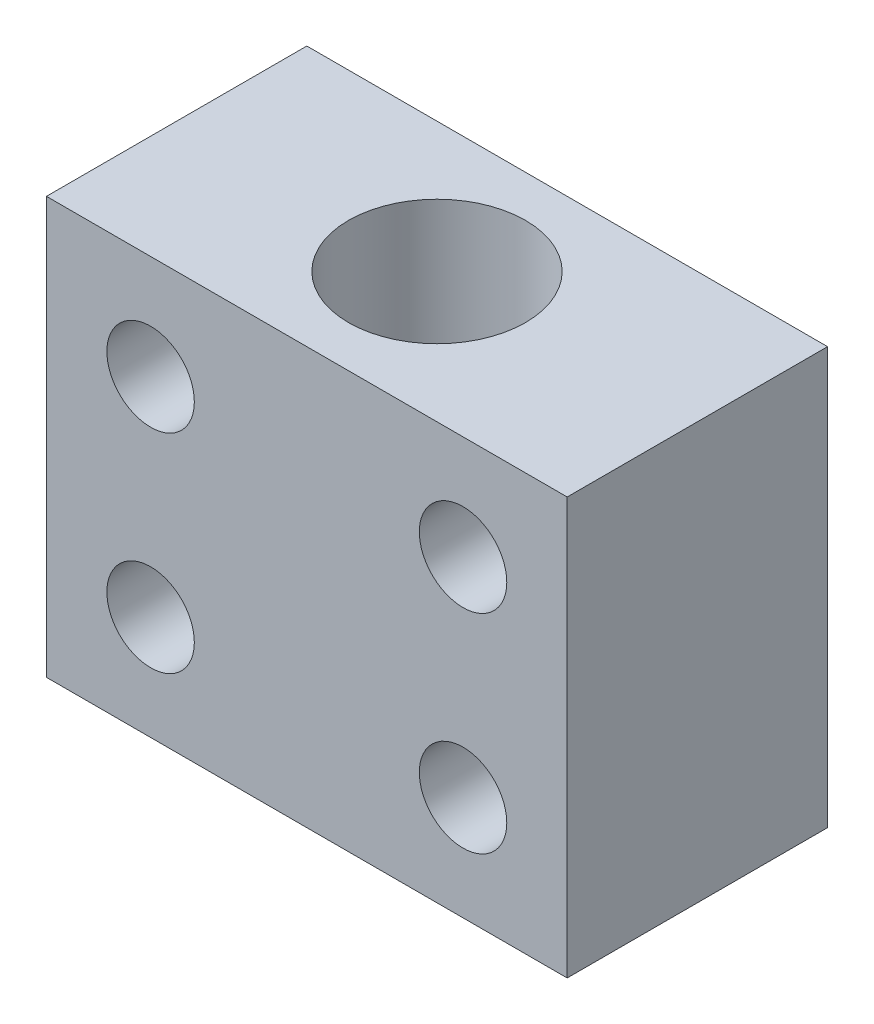
ISO-10303-21;
HEADER;
FILE_DESCRIPTION(('STEP AP214'),'2;1');
FILE_NAME('part.step','',(''),(''),'','','');
FILE_SCHEMA(('AUTOMOTIVE_DESIGN { 1 0 10303 214 1 1 1 1 }'));
ENDSEC;
DATA;
#1=APPLICATION_CONTEXT('core data for automotive mechanical design processes');
#2=APPLICATION_PROTOCOL_DEFINITION('international standard','automotive_design',2000,#1);
#3=PRODUCT_CONTEXT('',#1,'mechanical');
#4=PRODUCT('Part','Part','',(#3));
#5=PRODUCT_RELATED_PRODUCT_CATEGORY('part','',(#4));
#6=PRODUCT_DEFINITION_FORMATION('','',#4);
#7=PRODUCT_DEFINITION_CONTEXT('part definition',#1,'design');
#8=PRODUCT_DEFINITION('design','',#6,#7);
#9=PRODUCT_DEFINITION_SHAPE('','',#8);
#10=(LENGTH_UNIT() NAMED_UNIT(*) SI_UNIT(.MILLI.,.METRE.));
#11=(NAMED_UNIT(*) PLANE_ANGLE_UNIT() SI_UNIT($,.RADIAN.));
#12=(NAMED_UNIT(*) SI_UNIT($,.STERADIAN.) SOLID_ANGLE_UNIT());
#13=UNCERTAINTY_MEASURE_WITH_UNIT(LENGTH_MEASURE(1.E-05),#10,'distance_accuracy_value','');
#14=(GEOMETRIC_REPRESENTATION_CONTEXT(3) GLOBAL_UNCERTAINTY_ASSIGNED_CONTEXT((#13)) GLOBAL_UNIT_ASSIGNED_CONTEXT((#10,
#11,#12)) REPRESENTATION_CONTEXT('',''));
#15=CARTESIAN_POINT('',(0.,0.,0.));
#16=DIRECTION('',(0.,0.,1.));
#17=DIRECTION('',(1.,0.,0.));
#18=AXIS2_PLACEMENT_3D('',#15,#16,#17);
#19=CARTESIAN_POINT('',(0.,0.,-12.5));
#20=DIRECTION('',(0.,0.,-1.));
#21=DIRECTION('',(-1.,0.,0.));
#22=AXIS2_PLACEMENT_3D('',#19,#20,#21);
#23=PLANE('',#22);
#24=CARTESIAN_POINT('',(-15.,10.,-12.5));
#25=DIRECTION('',(0.,0.,1.));
#26=DIRECTION('',(1.,0.,0.));
#27=AXIS2_PLACEMENT_3D('',#24,#25,#26);
#28=CIRCLE('',#27,4.19999999999999);
#29=CARTESIAN_POINT('',(-10.8,10.,-12.5));
#30=VERTEX_POINT('',#29);
#31=EDGE_CURVE('E128',#30,#30,#28,.T.);
#32=ORIENTED_EDGE('',*,*,#31,.T.);
#33=EDGE_LOOP('',(#32));
#34=FACE_BOUND('',#33,.T.);
#35=DIRECTION('',(0.,1.,0.));
#36=VECTOR('',#35,1.);
#37=CARTESIAN_POINT('',(25.,-20.,-12.5));
#38=LINE('',#37,#36);
#39=CARTESIAN_POINT('',(25.,-20.,-12.5));
#40=VERTEX_POINT('',#39);
#41=CARTESIAN_POINT('',(25.,20.,-12.5));
#42=VERTEX_POINT('',#41);
#43=EDGE_CURVE('E97',#40,#42,#38,.T.);
#44=ORIENTED_EDGE('',*,*,#43,.F.);
#45=DIRECTION('',(1.,0.,0.));
#46=VECTOR('',#45,1.);
#47=CARTESIAN_POINT('',(-25.,-20.,-12.5));
#48=LINE('',#47,#46);
#49=CARTESIAN_POINT('',(-25.,-20.,-12.5));
#50=VERTEX_POINT('',#49);
#51=EDGE_CURVE('E73',#50,#40,#48,.T.);
#52=ORIENTED_EDGE('',*,*,#51,.F.);
#53=DIRECTION('',(0.,-1.,0.));
#54=VECTOR('',#53,1.);
#55=CARTESIAN_POINT('',(-25.,-20.,-12.5));
#56=LINE('',#55,#54);
#57=CARTESIAN_POINT('',(-25.,20.,-12.5));
#58=VERTEX_POINT('',#57);
#59=EDGE_CURVE('E67',#58,#50,#56,.T.);
#60=ORIENTED_EDGE('',*,*,#59,.F.);
#61=DIRECTION('',(-1.,0.,0.));
#62=VECTOR('',#61,1.);
#63=CARTESIAN_POINT('',(-25.,20.,-12.5));
#64=LINE('',#63,#62);
#65=EDGE_CURVE('E89',#42,#58,#64,.T.);
#66=ORIENTED_EDGE('',*,*,#65,.F.);
#67=EDGE_LOOP('',(#44,#52,#60,#66));
#68=FACE_BOUND('',#67,.T.);
#69=CARTESIAN_POINT('',(15.,10.,-12.5));
#70=DIRECTION('',(0.,0.,1.));
#71=DIRECTION('',(1.,0.,0.));
#72=AXIS2_PLACEMENT_3D('',#69,#70,#71);
#73=CIRCLE('',#72,4.19999999999999);
#74=CARTESIAN_POINT('',(19.2,10.,-12.5));
#75=VERTEX_POINT('',#74);
#76=EDGE_CURVE('E100',#75,#75,#73,.T.);
#77=ORIENTED_EDGE('',*,*,#76,.T.);
#78=EDGE_LOOP('',(#77));
#79=FACE_BOUND('',#78,.T.);
#80=CARTESIAN_POINT('',(15.,-10.,-12.5));
#81=DIRECTION('',(0.,0.,1.));
#82=DIRECTION('',(1.,0.,0.));
#83=AXIS2_PLACEMENT_3D('',#80,#81,#82);
#84=CIRCLE('',#83,4.19999999999999);
#85=CARTESIAN_POINT('',(19.2,-10.,-12.5));
#86=VERTEX_POINT('',#85);
#87=EDGE_CURVE('E116',#86,#86,#84,.T.);
#88=ORIENTED_EDGE('',*,*,#87,.T.);
#89=EDGE_LOOP('',(#88));
#90=FACE_BOUND('',#89,.T.);
#91=CARTESIAN_POINT('',(-15.,-10.,-12.5));
#92=DIRECTION('',(0.,0.,1.));
#93=DIRECTION('',(1.,0.,0.));
#94=AXIS2_PLACEMENT_3D('',#91,#92,#93);
#95=CIRCLE('',#94,4.19999999999999);
#96=CARTESIAN_POINT('',(-10.8,-10.,-12.5));
#97=VERTEX_POINT('',#96);
#98=EDGE_CURVE('E122',#97,#97,#95,.T.);
#99=ORIENTED_EDGE('',*,*,#98,.T.);
#100=EDGE_LOOP('',(#99));
#101=FACE_BOUND('',#100,.T.);
#102=ADVANCED_FACE('F33',(#34,#68,#79,#90,#101),#23,.T.);
#103=CARTESIAN_POINT('',(25.,-20.,12.5));
#104=DIRECTION('',(-1.,0.,0.));
#105=DIRECTION('',(0.,0.,1.));
#106=AXIS2_PLACEMENT_3D('',#103,#104,#105);
#107=PLANE('',#106);
#108=ORIENTED_EDGE('',*,*,#43,.T.);
#109=DIRECTION('',(0.,0.,-1.));
#110=VECTOR('',#109,1.);
#111=CARTESIAN_POINT('',(25.,20.,12.5));
#112=LINE('',#111,#110);
#113=CARTESIAN_POINT('',(25.,20.,12.5));
#114=VERTEX_POINT('',#113);
#115=EDGE_CURVE('E11',#114,#42,#112,.T.);
#116=ORIENTED_EDGE('',*,*,#115,.F.);
#117=DIRECTION('',(0.,1.,0.));
#118=VECTOR('',#117,1.);
#119=CARTESIAN_POINT('',(25.,-20.,12.5));
#120=LINE('',#119,#118);
#121=CARTESIAN_POINT('',(25.,-20.,12.5));
#122=VERTEX_POINT('',#121);
#123=EDGE_CURVE('E85',#122,#114,#120,.T.);
#124=ORIENTED_EDGE('',*,*,#123,.F.);
#125=DIRECTION('',(0.,0.,-1.));
#126=VECTOR('',#125,1.);
#127=CARTESIAN_POINT('',(25.,-20.,12.5));
#128=LINE('',#127,#126);
#129=EDGE_CURVE('E93',#122,#40,#128,.T.);
#130=ORIENTED_EDGE('',*,*,#129,.T.);
#131=EDGE_LOOP('',(#108,#116,#124,#130));
#132=FACE_BOUND('',#131,.T.);
#133=ADVANCED_FACE('F35',(#132),#107,.F.);
#134=CARTESIAN_POINT('',(-25.,20.,12.5));
#135=DIRECTION('',(0.,-1.,0.));
#136=DIRECTION('',(0.,0.,-1.));
#137=AXIS2_PLACEMENT_3D('',#134,#135,#136);
#138=PLANE('',#137);
#139=CARTESIAN_POINT('',(0.,20.,0.));
#140=DIRECTION('',(0.,1.,0.));
#141=DIRECTION('',(0.,0.,1.));
#142=AXIS2_PLACEMENT_3D('',#139,#140,#141);
#143=CIRCLE('',#142,8.5);
#144=CARTESIAN_POINT('',(0.,20.,8.5));
#145=VERTEX_POINT('',#144);
#146=EDGE_CURVE('E137',#145,#145,#143,.T.);
#147=ORIENTED_EDGE('',*,*,#146,.F.);
#148=EDGE_LOOP('',(#147));
#149=FACE_BOUND('',#148,.T.);
#150=ORIENTED_EDGE('',*,*,#65,.T.);
#151=DIRECTION('',(0.,0.,-1.));
#152=VECTOR('',#151,1.);
#153=CARTESIAN_POINT('',(-25.,20.,12.5));
#154=LINE('',#153,#152);
#155=CARTESIAN_POINT('',(-25.,20.,12.5));
#156=VERTEX_POINT('',#155);
#157=EDGE_CURVE('E42',#156,#58,#154,.T.);
#158=ORIENTED_EDGE('',*,*,#157,.F.);
#159=DIRECTION('',(-1.,0.,0.));
#160=VECTOR('',#159,1.);
#161=CARTESIAN_POINT('',(-25.,20.,12.5));
#162=LINE('',#161,#160);
#163=EDGE_CURVE('E80',#114,#156,#162,.T.);
#164=ORIENTED_EDGE('',*,*,#163,.F.);
#165=ORIENTED_EDGE('',*,*,#115,.T.);
#166=EDGE_LOOP('',(#150,#158,#164,#165));
#167=FACE_BOUND('',#166,.T.);
#168=ADVANCED_FACE('F88',(#149,#167),#138,.F.);
#169=CARTESIAN_POINT('',(-25.,-20.,12.5));
#170=DIRECTION('',(1.,0.,0.));
#171=DIRECTION('',(0.,0.,-1.));
#172=AXIS2_PLACEMENT_3D('',#169,#170,#171);
#173=PLANE('',#172);
#174=ORIENTED_EDGE('',*,*,#59,.T.);
#175=DIRECTION('',(0.,0.,-1.));
#176=VECTOR('',#175,1.);
#177=CARTESIAN_POINT('',(-25.,-20.,12.5));
#178=LINE('',#177,#176);
#179=CARTESIAN_POINT('',(-25.,-20.,12.5));
#180=VERTEX_POINT('',#179);
#181=EDGE_CURVE('E90',#180,#50,#178,.T.);
#182=ORIENTED_EDGE('',*,*,#181,.F.);
#183=DIRECTION('',(0.,-1.,0.));
#184=VECTOR('',#183,1.);
#185=CARTESIAN_POINT('',(-25.,-20.,12.5));
#186=LINE('',#185,#184);
#187=EDGE_CURVE('E83',#156,#180,#186,.T.);
#188=ORIENTED_EDGE('',*,*,#187,.F.);
#189=ORIENTED_EDGE('',*,*,#157,.T.);
#190=EDGE_LOOP('',(#174,#182,#188,#189));
#191=FACE_BOUND('',#190,.T.);
#192=ADVANCED_FACE('F91',(#191),#173,.F.);
#193=CARTESIAN_POINT('',(-25.,-20.,12.5));
#194=DIRECTION('',(0.,1.,0.));
#195=DIRECTION('',(0.,0.,1.));
#196=AXIS2_PLACEMENT_3D('',#193,#194,#195);
#197=PLANE('',#196);
#198=CARTESIAN_POINT('',(0.,-20.,0.));
#199=DIRECTION('',(0.,1.,0.));
#200=DIRECTION('',(0.,0.,1.));
#201=AXIS2_PLACEMENT_3D('',#198,#199,#200);
#202=CIRCLE('',#201,8.49999999999999);
#203=CARTESIAN_POINT('',(0.,-20.,8.49999999999999));
#204=VERTEX_POINT('',#203);
#205=EDGE_CURVE('E134',#204,#204,#202,.T.);
#206=ORIENTED_EDGE('',*,*,#205,.T.);
#207=EDGE_LOOP('',(#206));
#208=FACE_BOUND('',#207,.T.);
#209=ORIENTED_EDGE('',*,*,#51,.T.);
#210=ORIENTED_EDGE('',*,*,#129,.F.);
#211=DIRECTION('',(1.,0.,0.));
#212=VECTOR('',#211,1.);
#213=CARTESIAN_POINT('',(-25.,-20.,12.5));
#214=LINE('',#213,#212);
#215=EDGE_CURVE('E50',#180,#122,#214,.T.);
#216=ORIENTED_EDGE('',*,*,#215,.F.);
#217=ORIENTED_EDGE('',*,*,#181,.T.);
#218=EDGE_LOOP('',(#209,#210,#216,#217));
#219=FACE_BOUND('',#218,.T.);
#220=ADVANCED_FACE('F105',(#208,#219),#197,.F.);
#221=CARTESIAN_POINT('',(0.,0.,12.5));
#222=DIRECTION('',(0.,0.,-1.));
#223=DIRECTION('',(-1.,0.,0.));
#224=AXIS2_PLACEMENT_3D('',#221,#222,#223);
#225=PLANE('',#224);
#226=CARTESIAN_POINT('',(-15.,10.,12.5));
#227=DIRECTION('',(0.,0.,1.));
#228=DIRECTION('',(1.,0.,0.));
#229=AXIS2_PLACEMENT_3D('',#226,#227,#228);
#230=CIRCLE('',#229,4.19999999999999);
#231=CARTESIAN_POINT('',(-10.8,10.,12.5));
#232=VERTEX_POINT('',#231);
#233=EDGE_CURVE('E131',#232,#232,#230,.T.);
#234=ORIENTED_EDGE('',*,*,#233,.F.);
#235=EDGE_LOOP('',(#234));
#236=FACE_BOUND('',#235,.T.);
#237=CARTESIAN_POINT('',(-15.,-10.,12.5));
#238=DIRECTION('',(0.,0.,1.));
#239=DIRECTION('',(1.,0.,0.));
#240=AXIS2_PLACEMENT_3D('',#237,#238,#239);
#241=CIRCLE('',#240,4.19999999999999);
#242=CARTESIAN_POINT('',(-10.8,-10.,12.5));
#243=VERTEX_POINT('',#242);
#244=EDGE_CURVE('E125',#243,#243,#241,.T.);
#245=ORIENTED_EDGE('',*,*,#244,.F.);
#246=EDGE_LOOP('',(#245));
#247=FACE_BOUND('',#246,.T.);
#248=CARTESIAN_POINT('',(15.,-10.,12.5));
#249=DIRECTION('',(0.,0.,1.));
#250=DIRECTION('',(1.,0.,0.));
#251=AXIS2_PLACEMENT_3D('',#248,#249,#250);
#252=CIRCLE('',#251,4.19999999999999);
#253=CARTESIAN_POINT('',(19.2,-10.,12.5));
#254=VERTEX_POINT('',#253);
#255=EDGE_CURVE('E119',#254,#254,#252,.T.);
#256=ORIENTED_EDGE('',*,*,#255,.F.);
#257=EDGE_LOOP('',(#256));
#258=FACE_BOUND('',#257,.T.);
#259=CARTESIAN_POINT('',(15.,10.,12.5));
#260=DIRECTION('',(0.,0.,1.));
#261=DIRECTION('',(1.,0.,0.));
#262=AXIS2_PLACEMENT_3D('',#259,#260,#261);
#263=CIRCLE('',#262,4.19999999999999);
#264=CARTESIAN_POINT('',(19.2,10.,12.5));
#265=VERTEX_POINT('',#264);
#266=EDGE_CURVE('E113',#265,#265,#263,.T.);
#267=ORIENTED_EDGE('',*,*,#266,.F.);
#268=EDGE_LOOP('',(#267));
#269=FACE_BOUND('',#268,.T.);
#270=ORIENTED_EDGE('',*,*,#123,.T.);
#271=ORIENTED_EDGE('',*,*,#163,.T.);
#272=ORIENTED_EDGE('',*,*,#187,.T.);
#273=ORIENTED_EDGE('',*,*,#215,.T.);
#274=EDGE_LOOP('',(#270,#271,#272,#273));
#275=FACE_BOUND('',#274,.T.);
#276=ADVANCED_FACE('F81',(#236,#247,#258,#269,#275),#225,.F.);
#277=CARTESIAN_POINT('',(15.,10.,12.5));
#278=DIRECTION('',(0.,0.,1.));
#279=DIRECTION('',(1.,0.,0.));
#280=AXIS2_PLACEMENT_3D('',#277,#278,#279);
#281=CYLINDRICAL_SURFACE('',#280,4.19999999999999);
#282=ORIENTED_EDGE('',*,*,#76,.F.);
#283=EDGE_LOOP('',(#282));
#284=FACE_BOUND('',#283,.T.);
#285=ORIENTED_EDGE('',*,*,#266,.T.);
#286=EDGE_LOOP('',(#285));
#287=FACE_BOUND('',#286,.T.);
#288=ADVANCED_FACE('F162',(#284,#287),#281,.F.);
#289=CARTESIAN_POINT('',(15.,-10.,12.5));
#290=DIRECTION('',(0.,0.,1.));
#291=DIRECTION('',(1.,0.,0.));
#292=AXIS2_PLACEMENT_3D('',#289,#290,#291);
#293=CYLINDRICAL_SURFACE('',#292,4.19999999999999);
#294=ORIENTED_EDGE('',*,*,#87,.F.);
#295=EDGE_LOOP('',(#294));
#296=FACE_BOUND('',#295,.T.);
#297=ORIENTED_EDGE('',*,*,#255,.T.);
#298=EDGE_LOOP('',(#297));
#299=FACE_BOUND('',#298,.T.);
#300=ADVANCED_FACE('F178',(#296,#299),#293,.F.);
#301=CARTESIAN_POINT('',(-15.,-10.,12.5));
#302=DIRECTION('',(0.,0.,1.));
#303=DIRECTION('',(1.,0.,0.));
#304=AXIS2_PLACEMENT_3D('',#301,#302,#303);
#305=CYLINDRICAL_SURFACE('',#304,4.19999999999999);
#306=ORIENTED_EDGE('',*,*,#98,.F.);
#307=EDGE_LOOP('',(#306));
#308=FACE_BOUND('',#307,.T.);
#309=ORIENTED_EDGE('',*,*,#244,.T.);
#310=EDGE_LOOP('',(#309));
#311=FACE_BOUND('',#310,.T.);
#312=ADVANCED_FACE('F172',(#308,#311),#305,.F.);
#313=CARTESIAN_POINT('',(-15.,10.,12.5));
#314=DIRECTION('',(0.,0.,1.));
#315=DIRECTION('',(1.,0.,0.));
#316=AXIS2_PLACEMENT_3D('',#313,#314,#315);
#317=CYLINDRICAL_SURFACE('',#316,4.19999999999999);
#318=ORIENTED_EDGE('',*,*,#31,.F.);
#319=EDGE_LOOP('',(#318));
#320=FACE_BOUND('',#319,.T.);
#321=ORIENTED_EDGE('',*,*,#233,.T.);
#322=EDGE_LOOP('',(#321));
#323=FACE_BOUND('',#322,.T.);
#324=ADVANCED_FACE('F167',(#320,#323),#317,.F.);
#325=CARTESIAN_POINT('',(0.,20.,0.));
#326=DIRECTION('',(0.,1.,0.));
#327=DIRECTION('',(0.,0.,1.));
#328=AXIS2_PLACEMENT_3D('',#325,#326,#327);
#329=CYLINDRICAL_SURFACE('',#328,8.49999999999999);
#330=ORIENTED_EDGE('',*,*,#205,.F.);
#331=EDGE_LOOP('',(#330));
#332=FACE_BOUND('',#331,.T.);
#333=ORIENTED_EDGE('',*,*,#146,.T.);
#334=EDGE_LOOP('',(#333));
#335=FACE_BOUND('',#334,.T.);
#336=ADVANCED_FACE('F141',(#332,#335),#329,.F.);
#337=CLOSED_SHELL('',(#102,#133,#168,#192,#220,#276,#288,#300,#312,#324,#336));
#338=MANIFOLD_SOLID_BREP('B2',#337);
#339=ADVANCED_BREP_SHAPE_REPRESENTATION('',(#18,#338),#14);
#340=SHAPE_DEFINITION_REPRESENTATION(#9,#339);
ENDSEC;
END-ISO-10303-21;
